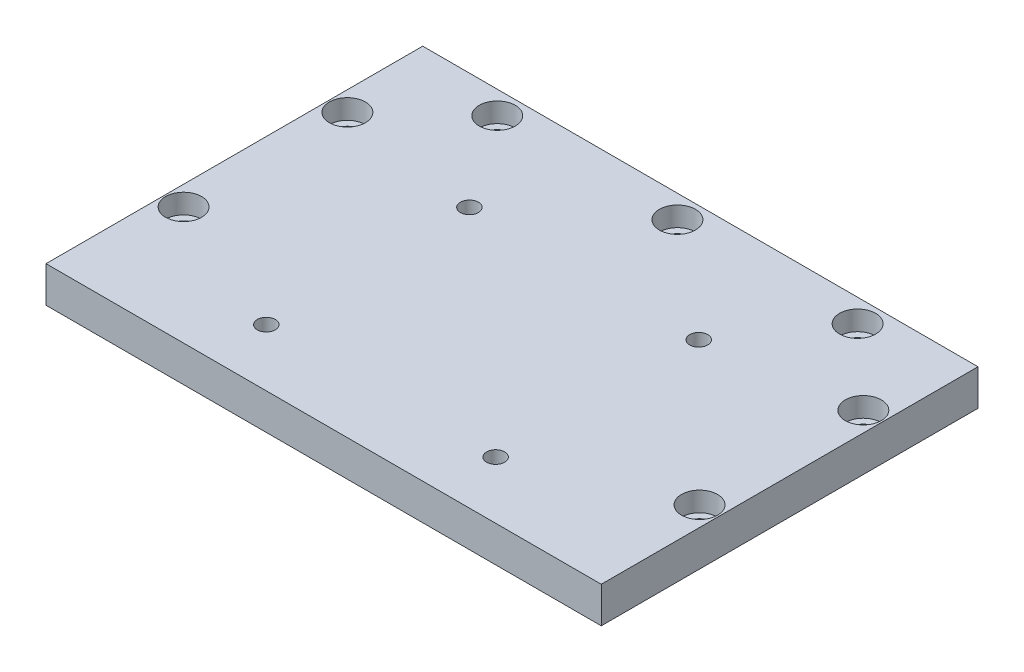
ISO-10303-21;
HEADER;
FILE_DESCRIPTION(('STEP AP214'),'2;1');
FILE_NAME('part.step','',(''),(''),'','','');
FILE_SCHEMA(('AUTOMOTIVE_DESIGN { 1 0 10303 214 1 1 1 1 }'));
ENDSEC;
DATA;
#1=APPLICATION_CONTEXT('core data for automotive mechanical design processes');
#2=APPLICATION_PROTOCOL_DEFINITION('international standard','automotive_design',2000,#1);
#3=PRODUCT_CONTEXT('',#1,'mechanical');
#4=PRODUCT('Part','Part','',(#3));
#5=PRODUCT_RELATED_PRODUCT_CATEGORY('part','',(#4));
#6=PRODUCT_DEFINITION_FORMATION('','',#4);
#7=PRODUCT_DEFINITION_CONTEXT('part definition',#1,'design');
#8=PRODUCT_DEFINITION('design','',#6,#7);
#9=PRODUCT_DEFINITION_SHAPE('','',#8);
#10=(LENGTH_UNIT() NAMED_UNIT(*) SI_UNIT(.MILLI.,.METRE.));
#11=(NAMED_UNIT(*) PLANE_ANGLE_UNIT() SI_UNIT($,.RADIAN.));
#12=(NAMED_UNIT(*) SI_UNIT($,.STERADIAN.) SOLID_ANGLE_UNIT());
#13=UNCERTAINTY_MEASURE_WITH_UNIT(LENGTH_MEASURE(1.E-05),#10,'distance_accuracy_value','');
#14=(GEOMETRIC_REPRESENTATION_CONTEXT(3) GLOBAL_UNCERTAINTY_ASSIGNED_CONTEXT((#13)) GLOBAL_UNIT_ASSIGNED_CONTEXT((#10,
#11,#12)) REPRESENTATION_CONTEXT('',''));
#15=CARTESIAN_POINT('',(0.,0.,0.));
#16=DIRECTION('',(0.,0.,1.));
#17=DIRECTION('',(1.,0.,0.));
#18=AXIS2_PLACEMENT_3D('',#15,#16,#17);
#19=CARTESIAN_POINT('',(78.75,0.,-36.));
#20=DIRECTION('',(0.,1.,0.));
#21=DIRECTION('',(0.,0.,1.));
#22=AXIS2_PLACEMENT_3D('',#19,#20,#21);
#23=CYLINDRICAL_SURFACE('',#22,5.5);
#24=CARTESIAN_POINT('',(78.75,-6.,-36.));
#25=DIRECTION('',(0.,1.,0.));
#26=DIRECTION('',(0.,0.,1.));
#27=AXIS2_PLACEMENT_3D('',#24,#25,#26);
#28=CIRCLE('',#27,5.5);
#29=CARTESIAN_POINT('',(78.75,-6.,-30.5));
#30=VERTEX_POINT('',#29);
#31=EDGE_CURVE('E20',#30,#30,#28,.F.);
#32=ORIENTED_EDGE('',*,*,#31,.T.);
#33=EDGE_LOOP('',(#32));
#34=FACE_BOUND('',#33,.T.);
#35=CARTESIAN_POINT('',(78.75,0.,-36.));
#36=DIRECTION('',(0.,1.,0.));
#37=DIRECTION('',(0.,0.,1.));
#38=AXIS2_PLACEMENT_3D('',#35,#36,#37);
#39=CIRCLE('',#38,5.5);
#40=CARTESIAN_POINT('',(78.75,0.,-30.5));
#41=VERTEX_POINT('',#40);
#42=EDGE_CURVE('E180',#41,#41,#39,.T.);
#43=ORIENTED_EDGE('',*,*,#42,.T.);
#44=EDGE_LOOP('',(#43));
#45=FACE_BOUND('',#44,.T.);
#46=ADVANCED_FACE('F17',(#34,#45),#23,.F.);
#47=CARTESIAN_POINT('',(78.75,0.,-86.));
#48=DIRECTION('',(0.,1.,0.));
#49=DIRECTION('',(0.,0.,1.));
#50=AXIS2_PLACEMENT_3D('',#47,#48,#49);
#51=CYLINDRICAL_SURFACE('',#50,5.50000000000001);
#52=CARTESIAN_POINT('',(78.75,-6.,-86.));
#53=DIRECTION('',(0.,1.,0.));
#54=DIRECTION('',(0.,0.,1.));
#55=AXIS2_PLACEMENT_3D('',#52,#53,#54);
#56=CIRCLE('',#55,5.50000000000001);
#57=CARTESIAN_POINT('',(78.75,-6.,-80.5));
#58=VERTEX_POINT('',#57);
#59=EDGE_CURVE('E209',#58,#58,#56,.F.);
#60=ORIENTED_EDGE('',*,*,#59,.T.);
#61=EDGE_LOOP('',(#60));
#62=FACE_BOUND('',#61,.T.);
#63=CARTESIAN_POINT('',(78.75,0.,-86.));
#64=DIRECTION('',(0.,1.,0.));
#65=DIRECTION('',(0.,0.,1.));
#66=AXIS2_PLACEMENT_3D('',#63,#64,#65);
#67=CIRCLE('',#66,5.50000000000001);
#68=CARTESIAN_POINT('',(78.75,0.,-80.5));
#69=VERTEX_POINT('',#68);
#70=EDGE_CURVE('E177',#69,#69,#67,.T.);
#71=ORIENTED_EDGE('',*,*,#70,.T.);
#72=EDGE_LOOP('',(#71));
#73=FACE_BOUND('',#72,.T.);
#74=ADVANCED_FACE('F367',(#62,#73),#51,.F.);
#75=CARTESIAN_POINT('',(55.,0.,-108.));
#76=DIRECTION('',(0.,1.,0.));
#77=DIRECTION('',(0.,0.,1.));
#78=AXIS2_PLACEMENT_3D('',#75,#76,#77);
#79=CYLINDRICAL_SURFACE('',#78,5.50000000000001);
#80=CARTESIAN_POINT('',(55.,-6.,-108.));
#81=DIRECTION('',(0.,1.,0.));
#82=DIRECTION('',(0.,0.,1.));
#83=AXIS2_PLACEMENT_3D('',#80,#81,#82);
#84=CIRCLE('',#83,5.50000000000001);
#85=CARTESIAN_POINT('',(55.,-6.,-102.5));
#86=VERTEX_POINT('',#85);
#87=EDGE_CURVE('E207',#86,#86,#84,.F.);
#88=ORIENTED_EDGE('',*,*,#87,.T.);
#89=EDGE_LOOP('',(#88));
#90=FACE_BOUND('',#89,.T.);
#91=CARTESIAN_POINT('',(55.,0.,-108.));
#92=DIRECTION('',(0.,1.,0.));
#93=DIRECTION('',(0.,0.,1.));
#94=AXIS2_PLACEMENT_3D('',#91,#92,#93);
#95=CIRCLE('',#94,5.50000000000001);
#96=CARTESIAN_POINT('',(55.,0.,-102.5));
#97=VERTEX_POINT('',#96);
#98=EDGE_CURVE('E174',#97,#97,#95,.T.);
#99=ORIENTED_EDGE('',*,*,#98,.T.);
#100=EDGE_LOOP('',(#99));
#101=FACE_BOUND('',#100,.T.);
#102=ADVANCED_FACE('F364',(#90,#101),#79,.F.);
#103=CARTESIAN_POINT('',(0.,0.,-108.));
#104=DIRECTION('',(0.,1.,0.));
#105=DIRECTION('',(0.,0.,1.));
#106=AXIS2_PLACEMENT_3D('',#103,#104,#105);
#107=CYLINDRICAL_SURFACE('',#106,5.50000000000001);
#108=CARTESIAN_POINT('',(0.,-6.,-108.));
#109=DIRECTION('',(0.,1.,0.));
#110=DIRECTION('',(0.,0.,1.));
#111=AXIS2_PLACEMENT_3D('',#108,#109,#110);
#112=CIRCLE('',#111,5.50000000000001);
#113=CARTESIAN_POINT('',(0.,-6.,-102.5));
#114=VERTEX_POINT('',#113);
#115=EDGE_CURVE('E204',#114,#114,#112,.F.);
#116=ORIENTED_EDGE('',*,*,#115,.T.);
#117=EDGE_LOOP('',(#116));
#118=FACE_BOUND('',#117,.T.);
#119=CARTESIAN_POINT('',(0.,0.,-108.));
#120=DIRECTION('',(0.,1.,0.));
#121=DIRECTION('',(0.,0.,1.));
#122=AXIS2_PLACEMENT_3D('',#119,#120,#121);
#123=CIRCLE('',#122,5.50000000000001);
#124=CARTESIAN_POINT('',(0.,0.,-102.5));
#125=VERTEX_POINT('',#124);
#126=EDGE_CURVE('E171',#125,#125,#123,.T.);
#127=ORIENTED_EDGE('',*,*,#126,.T.);
#128=EDGE_LOOP('',(#127));
#129=FACE_BOUND('',#128,.T.);
#130=ADVANCED_FACE('F360',(#118,#129),#107,.F.);
#131=CARTESIAN_POINT('',(-55.,0.,-108.));
#132=DIRECTION('',(0.,1.,0.));
#133=DIRECTION('',(0.,0.,1.));
#134=AXIS2_PLACEMENT_3D('',#131,#132,#133);
#135=CYLINDRICAL_SURFACE('',#134,5.50000000000001);
#136=CARTESIAN_POINT('',(-55.,-6.,-108.));
#137=DIRECTION('',(0.,1.,0.));
#138=DIRECTION('',(0.,0.,1.));
#139=AXIS2_PLACEMENT_3D('',#136,#137,#138);
#140=CIRCLE('',#139,5.50000000000001);
#141=CARTESIAN_POINT('',(-55.,-6.,-102.5));
#142=VERTEX_POINT('',#141);
#143=EDGE_CURVE('E201',#142,#142,#140,.F.);
#144=ORIENTED_EDGE('',*,*,#143,.T.);
#145=EDGE_LOOP('',(#144));
#146=FACE_BOUND('',#145,.T.);
#147=CARTESIAN_POINT('',(-55.,0.,-108.));
#148=DIRECTION('',(0.,1.,0.));
#149=DIRECTION('',(0.,0.,1.));
#150=AXIS2_PLACEMENT_3D('',#147,#148,#149);
#151=CIRCLE('',#150,5.50000000000001);
#152=CARTESIAN_POINT('',(-55.,0.,-102.5));
#153=VERTEX_POINT('',#152);
#154=EDGE_CURVE('E168',#153,#153,#151,.T.);
#155=ORIENTED_EDGE('',*,*,#154,.T.);
#156=EDGE_LOOP('',(#155));
#157=FACE_BOUND('',#156,.T.);
#158=ADVANCED_FACE('F356',(#146,#157),#135,.F.);
#159=CARTESIAN_POINT('',(-78.75,0.,-36.));
#160=DIRECTION('',(0.,1.,0.));
#161=DIRECTION('',(0.,0.,1.));
#162=AXIS2_PLACEMENT_3D('',#159,#160,#161);
#163=CYLINDRICAL_SURFACE('',#162,5.5);
#164=CARTESIAN_POINT('',(-78.75,-6.,-36.));
#165=DIRECTION('',(0.,1.,0.));
#166=DIRECTION('',(0.,0.,1.));
#167=AXIS2_PLACEMENT_3D('',#164,#165,#166);
#168=CIRCLE('',#167,5.5);
#169=CARTESIAN_POINT('',(-78.75,-6.,-30.5));
#170=VERTEX_POINT('',#169);
#171=EDGE_CURVE('E198',#170,#170,#168,.F.);
#172=ORIENTED_EDGE('',*,*,#171,.T.);
#173=EDGE_LOOP('',(#172));
#174=FACE_BOUND('',#173,.T.);
#175=CARTESIAN_POINT('',(-78.75,0.,-36.));
#176=DIRECTION('',(0.,1.,0.));
#177=DIRECTION('',(0.,0.,1.));
#178=AXIS2_PLACEMENT_3D('',#175,#176,#177);
#179=CIRCLE('',#178,5.5);
#180=CARTESIAN_POINT('',(-78.75,0.,-30.5));
#181=VERTEX_POINT('',#180);
#182=EDGE_CURVE('E165',#181,#181,#179,.T.);
#183=ORIENTED_EDGE('',*,*,#182,.T.);
#184=EDGE_LOOP('',(#183));
#185=FACE_BOUND('',#184,.T.);
#186=ADVANCED_FACE('F352',(#174,#185),#163,.F.);
#187=CARTESIAN_POINT('',(-78.75,0.,-86.));
#188=DIRECTION('',(0.,1.,0.));
#189=DIRECTION('',(0.,0.,1.));
#190=AXIS2_PLACEMENT_3D('',#187,#188,#189);
#191=CYLINDRICAL_SURFACE('',#190,5.50000000000001);
#192=CARTESIAN_POINT('',(-78.75,-6.,-86.));
#193=DIRECTION('',(0.,1.,0.));
#194=DIRECTION('',(0.,0.,1.));
#195=AXIS2_PLACEMENT_3D('',#192,#193,#194);
#196=CIRCLE('',#195,5.50000000000001);
#197=CARTESIAN_POINT('',(-78.75,-6.,-80.5));
#198=VERTEX_POINT('',#197);
#199=EDGE_CURVE('E195',#198,#198,#196,.F.);
#200=ORIENTED_EDGE('',*,*,#199,.T.);
#201=EDGE_LOOP('',(#200));
#202=FACE_BOUND('',#201,.T.);
#203=CARTESIAN_POINT('',(-78.75,0.,-86.));
#204=DIRECTION('',(0.,1.,0.));
#205=DIRECTION('',(0.,0.,1.));
#206=AXIS2_PLACEMENT_3D('',#203,#204,#205);
#207=CIRCLE('',#206,5.50000000000001);
#208=CARTESIAN_POINT('',(-78.75,0.,-80.5));
#209=VERTEX_POINT('',#208);
#210=EDGE_CURVE('E162',#209,#209,#207,.T.);
#211=ORIENTED_EDGE('',*,*,#210,.T.);
#212=EDGE_LOOP('',(#211));
#213=FACE_BOUND('',#212,.T.);
#214=ADVANCED_FACE('F348',(#202,#213),#191,.F.);
#215=CARTESIAN_POINT('',(35.,-11.,-17.5));
#216=DIRECTION('',(0.,-1.,0.));
#217=DIRECTION('',(0.,0.,-1.));
#218=AXIS2_PLACEMENT_3D('',#215,#216,#217);
#219=CYLINDRICAL_SURFACE('',#218,2.75);
#220=CARTESIAN_POINT('',(35.,-6.,-17.5));
#221=DIRECTION('',(0.,-1.,0.));
#222=DIRECTION('',(0.,0.,-1.));
#223=AXIS2_PLACEMENT_3D('',#220,#221,#222);
#224=CIRCLE('',#223,2.75);
#225=CARTESIAN_POINT('',(35.,-6.,-20.25));
#226=VERTEX_POINT('',#225);
#227=EDGE_CURVE('E192',#226,#226,#224,.T.);
#228=ORIENTED_EDGE('',*,*,#227,.T.);
#229=EDGE_LOOP('',(#228));
#230=FACE_BOUND('',#229,.T.);
#231=CARTESIAN_POINT('',(35.,0.,-17.5));
#232=DIRECTION('',(0.,-1.,0.));
#233=DIRECTION('',(0.,0.,-1.));
#234=AXIS2_PLACEMENT_3D('',#231,#232,#233);
#235=CIRCLE('',#234,2.75);
#236=CARTESIAN_POINT('',(35.,0.,-20.25));
#237=VERTEX_POINT('',#236);
#238=EDGE_CURVE('E159',#237,#237,#235,.F.);
#239=ORIENTED_EDGE('',*,*,#238,.T.);
#240=EDGE_LOOP('',(#239));
#241=FACE_BOUND('',#240,.T.);
#242=ADVANCED_FACE('F344',(#230,#241),#219,.F.);
#243=CARTESIAN_POINT('',(35.,-11.,-79.5));
#244=DIRECTION('',(0.,-1.,0.));
#245=DIRECTION('',(0.,0.,-1.));
#246=AXIS2_PLACEMENT_3D('',#243,#244,#245);
#247=CYLINDRICAL_SURFACE('',#246,2.75);
#248=CARTESIAN_POINT('',(35.,-6.,-79.5));
#249=DIRECTION('',(0.,-1.,0.));
#250=DIRECTION('',(0.,0.,-1.));
#251=AXIS2_PLACEMENT_3D('',#248,#249,#250);
#252=CIRCLE('',#251,2.75);
#253=CARTESIAN_POINT('',(35.,-6.,-82.25));
#254=VERTEX_POINT('',#253);
#255=EDGE_CURVE('E189',#254,#254,#252,.T.);
#256=ORIENTED_EDGE('',*,*,#255,.T.);
#257=EDGE_LOOP('',(#256));
#258=FACE_BOUND('',#257,.T.);
#259=CARTESIAN_POINT('',(35.,0.,-79.5));
#260=DIRECTION('',(0.,-1.,0.));
#261=DIRECTION('',(0.,0.,-1.));
#262=AXIS2_PLACEMENT_3D('',#259,#260,#261);
#263=CIRCLE('',#262,2.75);
#264=CARTESIAN_POINT('',(35.,0.,-82.25));
#265=VERTEX_POINT('',#264);
#266=EDGE_CURVE('E156',#265,#265,#263,.F.);
#267=ORIENTED_EDGE('',*,*,#266,.T.);
#268=EDGE_LOOP('',(#267));
#269=FACE_BOUND('',#268,.T.);
#270=ADVANCED_FACE('F340',(#258,#269),#247,.F.);
#271=CARTESIAN_POINT('',(-35.,-11.,-79.5));
#272=DIRECTION('',(0.,-1.,0.));
#273=DIRECTION('',(0.,0.,-1.));
#274=AXIS2_PLACEMENT_3D('',#271,#272,#273);
#275=CYLINDRICAL_SURFACE('',#274,2.75);
#276=CARTESIAN_POINT('',(-35.,-6.,-79.5));
#277=DIRECTION('',(0.,-1.,0.));
#278=DIRECTION('',(0.,0.,-1.));
#279=AXIS2_PLACEMENT_3D('',#276,#277,#278);
#280=CIRCLE('',#279,2.75);
#281=CARTESIAN_POINT('',(-35.,-6.,-82.25));
#282=VERTEX_POINT('',#281);
#283=EDGE_CURVE('E186',#282,#282,#280,.T.);
#284=ORIENTED_EDGE('',*,*,#283,.T.);
#285=EDGE_LOOP('',(#284));
#286=FACE_BOUND('',#285,.T.);
#287=CARTESIAN_POINT('',(-35.,0.,-79.5));
#288=DIRECTION('',(0.,-1.,0.));
#289=DIRECTION('',(0.,0.,-1.));
#290=AXIS2_PLACEMENT_3D('',#287,#288,#289);
#291=CIRCLE('',#290,2.75);
#292=CARTESIAN_POINT('',(-35.,0.,-82.25));
#293=VERTEX_POINT('',#292);
#294=EDGE_CURVE('E153',#293,#293,#291,.F.);
#295=ORIENTED_EDGE('',*,*,#294,.T.);
#296=EDGE_LOOP('',(#295));
#297=FACE_BOUND('',#296,.T.);
#298=ADVANCED_FACE('F336',(#286,#297),#275,.F.);
#299=CARTESIAN_POINT('',(-35.,-11.,-17.5));
#300=DIRECTION('',(0.,-1.,0.));
#301=DIRECTION('',(0.,0.,-1.));
#302=AXIS2_PLACEMENT_3D('',#299,#300,#301);
#303=CYLINDRICAL_SURFACE('',#302,2.75);
#304=CARTESIAN_POINT('',(-35.,-6.,-17.5));
#305=DIRECTION('',(0.,-1.,0.));
#306=DIRECTION('',(0.,0.,-1.));
#307=AXIS2_PLACEMENT_3D('',#304,#305,#306);
#308=CIRCLE('',#307,2.75);
#309=CARTESIAN_POINT('',(-35.,-6.,-20.25));
#310=VERTEX_POINT('',#309);
#311=EDGE_CURVE('E183',#310,#310,#308,.T.);
#312=ORIENTED_EDGE('',*,*,#311,.T.);
#313=EDGE_LOOP('',(#312));
#314=FACE_BOUND('',#313,.T.);
#315=CARTESIAN_POINT('',(-35.,0.,-17.5));
#316=DIRECTION('',(0.,-1.,0.));
#317=DIRECTION('',(0.,0.,-1.));
#318=AXIS2_PLACEMENT_3D('',#315,#316,#317);
#319=CIRCLE('',#318,2.75);
#320=CARTESIAN_POINT('',(-35.,0.,-20.25));
#321=VERTEX_POINT('',#320);
#322=EDGE_CURVE('E150',#321,#321,#319,.F.);
#323=ORIENTED_EDGE('',*,*,#322,.T.);
#324=EDGE_LOOP('',(#323));
#325=FACE_BOUND('',#324,.T.);
#326=ADVANCED_FACE('F222',(#314,#325),#303,.F.);
#327=CARTESIAN_POINT('',(82.05,-6.,-36.));
#328=DIRECTION('',(0.,-1.,0.));
#329=DIRECTION('',(0.,0.,-1.));
#330=AXIS2_PLACEMENT_3D('',#327,#328,#329);
#331=PLANE('',#330);
#332=ORIENTED_EDGE('',*,*,#31,.F.);
#333=EDGE_LOOP('',(#332));
#334=FACE_BOUND('',#333,.T.);
#335=CARTESIAN_POINT('',(78.75,-6.,-36.));
#336=DIRECTION('',(0.,1.,0.));
#337=DIRECTION('',(0.,0.,1.));
#338=AXIS2_PLACEMENT_3D('',#335,#336,#337);
#339=CIRCLE('',#338,3.3);
#340=CARTESIAN_POINT('',(78.75,-6.,-32.7));
#341=VERTEX_POINT('',#340);
#342=EDGE_CURVE('E147',#341,#341,#339,.F.);
#343=ORIENTED_EDGE('',*,*,#342,.T.);
#344=EDGE_LOOP('',(#343));
#345=FACE_BOUND('',#344,.T.);
#346=ADVANCED_FACE('F218',(#334,#345),#331,.F.);
#347=CARTESIAN_POINT('',(82.05,-6.,-86.));
#348=DIRECTION('',(0.,-1.,0.));
#349=DIRECTION('',(0.,0.,-1.));
#350=AXIS2_PLACEMENT_3D('',#347,#348,#349);
#351=PLANE('',#350);
#352=ORIENTED_EDGE('',*,*,#59,.F.);
#353=EDGE_LOOP('',(#352));
#354=FACE_BOUND('',#353,.T.);
#355=CARTESIAN_POINT('',(78.75,-6.,-86.));
#356=DIRECTION('',(0.,1.,0.));
#357=DIRECTION('',(0.,0.,1.));
#358=AXIS2_PLACEMENT_3D('',#355,#356,#357);
#359=CIRCLE('',#358,3.3);
#360=CARTESIAN_POINT('',(78.75,-6.,-82.7));
#361=VERTEX_POINT('',#360);
#362=EDGE_CURVE('E144',#361,#361,#359,.F.);
#363=ORIENTED_EDGE('',*,*,#362,.T.);
#364=EDGE_LOOP('',(#363));
#365=FACE_BOUND('',#364,.T.);
#366=ADVANCED_FACE('F221',(#354,#365),#351,.F.);
#367=CARTESIAN_POINT('',(58.3,-6.,-108.));
#368=DIRECTION('',(0.,-1.,0.));
#369=DIRECTION('',(0.,0.,-1.));
#370=AXIS2_PLACEMENT_3D('',#367,#368,#369);
#371=PLANE('',#370);
#372=ORIENTED_EDGE('',*,*,#87,.F.);
#373=EDGE_LOOP('',(#372));
#374=FACE_BOUND('',#373,.T.);
#375=CARTESIAN_POINT('',(55.,-6.,-108.));
#376=DIRECTION('',(0.,1.,0.));
#377=DIRECTION('',(0.,0.,1.));
#378=AXIS2_PLACEMENT_3D('',#375,#376,#377);
#379=CIRCLE('',#378,3.3);
#380=CARTESIAN_POINT('',(55.,-6.,-104.7));
#381=VERTEX_POINT('',#380);
#382=EDGE_CURVE('E141',#381,#381,#379,.F.);
#383=ORIENTED_EDGE('',*,*,#382,.T.);
#384=EDGE_LOOP('',(#383));
#385=FACE_BOUND('',#384,.T.);
#386=ADVANCED_FACE('F326',(#374,#385),#371,.F.);
#387=CARTESIAN_POINT('',(3.3,-6.,-108.));
#388=DIRECTION('',(0.,-1.,0.));
#389=DIRECTION('',(0.,0.,-1.));
#390=AXIS2_PLACEMENT_3D('',#387,#388,#389);
#391=PLANE('',#390);
#392=ORIENTED_EDGE('',*,*,#115,.F.);
#393=EDGE_LOOP('',(#392));
#394=FACE_BOUND('',#393,.T.);
#395=CARTESIAN_POINT('',(0.,-6.,-108.));
#396=DIRECTION('',(0.,1.,0.));
#397=DIRECTION('',(0.,0.,1.));
#398=AXIS2_PLACEMENT_3D('',#395,#396,#397);
#399=CIRCLE('',#398,3.3);
#400=CARTESIAN_POINT('',(0.,-6.,-104.7));
#401=VERTEX_POINT('',#400);
#402=EDGE_CURVE('E138',#401,#401,#399,.F.);
#403=ORIENTED_EDGE('',*,*,#402,.T.);
#404=EDGE_LOOP('',(#403));
#405=FACE_BOUND('',#404,.T.);
#406=ADVANCED_FACE('F322',(#394,#405),#391,.F.);
#407=CARTESIAN_POINT('',(-51.7,-6.,-108.));
#408=DIRECTION('',(0.,-1.,0.));
#409=DIRECTION('',(0.,0.,-1.));
#410=AXIS2_PLACEMENT_3D('',#407,#408,#409);
#411=PLANE('',#410);
#412=ORIENTED_EDGE('',*,*,#143,.F.);
#413=EDGE_LOOP('',(#412));
#414=FACE_BOUND('',#413,.T.);
#415=CARTESIAN_POINT('',(-55.,-6.,-108.));
#416=DIRECTION('',(0.,1.,0.));
#417=DIRECTION('',(0.,0.,1.));
#418=AXIS2_PLACEMENT_3D('',#415,#416,#417);
#419=CIRCLE('',#418,3.3);
#420=CARTESIAN_POINT('',(-55.,-6.,-104.7));
#421=VERTEX_POINT('',#420);
#422=EDGE_CURVE('E135',#421,#421,#419,.F.);
#423=ORIENTED_EDGE('',*,*,#422,.T.);
#424=EDGE_LOOP('',(#423));
#425=FACE_BOUND('',#424,.T.);
#426=ADVANCED_FACE('F318',(#414,#425),#411,.F.);
#427=CARTESIAN_POINT('',(-75.45,-6.,-36.));
#428=DIRECTION('',(0.,-1.,0.));
#429=DIRECTION('',(0.,0.,-1.));
#430=AXIS2_PLACEMENT_3D('',#427,#428,#429);
#431=PLANE('',#430);
#432=ORIENTED_EDGE('',*,*,#171,.F.);
#433=EDGE_LOOP('',(#432));
#434=FACE_BOUND('',#433,.T.);
#435=CARTESIAN_POINT('',(-78.75,-6.,-36.));
#436=DIRECTION('',(0.,1.,0.));
#437=DIRECTION('',(0.,0.,1.));
#438=AXIS2_PLACEMENT_3D('',#435,#436,#437);
#439=CIRCLE('',#438,3.3);
#440=CARTESIAN_POINT('',(-78.75,-6.,-32.7));
#441=VERTEX_POINT('',#440);
#442=EDGE_CURVE('E132',#441,#441,#439,.F.);
#443=ORIENTED_EDGE('',*,*,#442,.T.);
#444=EDGE_LOOP('',(#443));
#445=FACE_BOUND('',#444,.T.);
#446=ADVANCED_FACE('F314',(#434,#445),#431,.F.);
#447=CARTESIAN_POINT('',(-75.45,-6.,-86.));
#448=DIRECTION('',(0.,-1.,0.));
#449=DIRECTION('',(0.,0.,-1.));
#450=AXIS2_PLACEMENT_3D('',#447,#448,#449);
#451=PLANE('',#450);
#452=ORIENTED_EDGE('',*,*,#199,.F.);
#453=EDGE_LOOP('',(#452));
#454=FACE_BOUND('',#453,.T.);
#455=CARTESIAN_POINT('',(-78.75,-6.,-86.));
#456=DIRECTION('',(0.,1.,0.));
#457=DIRECTION('',(0.,0.,1.));
#458=AXIS2_PLACEMENT_3D('',#455,#456,#457);
#459=CIRCLE('',#458,3.3);
#460=CARTESIAN_POINT('',(-78.75,-6.,-82.7));
#461=VERTEX_POINT('',#460);
#462=EDGE_CURVE('E129',#461,#461,#459,.F.);
#463=ORIENTED_EDGE('',*,*,#462,.T.);
#464=EDGE_LOOP('',(#463));
#465=FACE_BOUND('',#464,.T.);
#466=ADVANCED_FACE('F310',(#454,#465),#451,.F.);
#467=CARTESIAN_POINT('',(37.75,-6.,-17.5));
#468=DIRECTION('',(0.,1.,0.));
#469=DIRECTION('',(0.,0.,1.));
#470=AXIS2_PLACEMENT_3D('',#467,#468,#469);
#471=PLANE('',#470);
#472=CARTESIAN_POINT('',(35.,-6.,-17.5));
#473=DIRECTION('',(0.,-1.,0.));
#474=DIRECTION('',(0.,0.,-1.));
#475=AXIS2_PLACEMENT_3D('',#472,#473,#474);
#476=CIRCLE('',#475,5.);
#477=CARTESIAN_POINT('',(35.,-6.,-22.5));
#478=VERTEX_POINT('',#477);
#479=EDGE_CURVE('E126',#478,#478,#476,.T.);
#480=ORIENTED_EDGE('',*,*,#479,.T.);
#481=EDGE_LOOP('',(#480));
#482=FACE_BOUND('',#481,.T.);
#483=ORIENTED_EDGE('',*,*,#227,.F.);
#484=EDGE_LOOP('',(#483));
#485=FACE_BOUND('',#484,.T.);
#486=ADVANCED_FACE('F306',(#482,#485),#471,.F.);
#487=CARTESIAN_POINT('',(37.75,-6.,-79.5));
#488=DIRECTION('',(0.,1.,0.));
#489=DIRECTION('',(0.,0.,1.));
#490=AXIS2_PLACEMENT_3D('',#487,#488,#489);
#491=PLANE('',#490);
#492=CARTESIAN_POINT('',(35.,-6.,-79.5));
#493=DIRECTION('',(0.,-1.,0.));
#494=DIRECTION('',(0.,0.,-1.));
#495=AXIS2_PLACEMENT_3D('',#492,#493,#494);
#496=CIRCLE('',#495,5.);
#497=CARTESIAN_POINT('',(35.,-6.,-84.5));
#498=VERTEX_POINT('',#497);
#499=EDGE_CURVE('E123',#498,#498,#496,.T.);
#500=ORIENTED_EDGE('',*,*,#499,.T.);
#501=EDGE_LOOP('',(#500));
#502=FACE_BOUND('',#501,.T.);
#503=ORIENTED_EDGE('',*,*,#255,.F.);
#504=EDGE_LOOP('',(#503));
#505=FACE_BOUND('',#504,.T.);
#506=ADVANCED_FACE('F302',(#502,#505),#491,.F.);
#507=CARTESIAN_POINT('',(-32.25,-6.,-79.5));
#508=DIRECTION('',(0.,1.,0.));
#509=DIRECTION('',(0.,0.,1.));
#510=AXIS2_PLACEMENT_3D('',#507,#508,#509);
#511=PLANE('',#510);
#512=CARTESIAN_POINT('',(-35.,-6.,-79.5));
#513=DIRECTION('',(0.,-1.,0.));
#514=DIRECTION('',(0.,0.,-1.));
#515=AXIS2_PLACEMENT_3D('',#512,#513,#514);
#516=CIRCLE('',#515,5.);
#517=CARTESIAN_POINT('',(-35.,-6.,-84.5));
#518=VERTEX_POINT('',#517);
#519=EDGE_CURVE('E120',#518,#518,#516,.T.);
#520=ORIENTED_EDGE('',*,*,#519,.T.);
#521=EDGE_LOOP('',(#520));
#522=FACE_BOUND('',#521,.T.);
#523=ORIENTED_EDGE('',*,*,#283,.F.);
#524=EDGE_LOOP('',(#523));
#525=FACE_BOUND('',#524,.T.);
#526=ADVANCED_FACE('F298',(#522,#525),#511,.F.);
#527=CARTESIAN_POINT('',(-32.25,-6.,-17.5));
#528=DIRECTION('',(0.,1.,0.));
#529=DIRECTION('',(0.,0.,1.));
#530=AXIS2_PLACEMENT_3D('',#527,#528,#529);
#531=PLANE('',#530);
#532=CARTESIAN_POINT('',(-35.,-6.,-17.5));
#533=DIRECTION('',(0.,-1.,0.));
#534=DIRECTION('',(0.,0.,-1.));
#535=AXIS2_PLACEMENT_3D('',#532,#533,#534);
#536=CIRCLE('',#535,5.);
#537=CARTESIAN_POINT('',(-35.,-6.,-22.5));
#538=VERTEX_POINT('',#537);
#539=EDGE_CURVE('E69',#538,#538,#536,.T.);
#540=ORIENTED_EDGE('',*,*,#539,.T.);
#541=EDGE_LOOP('',(#540));
#542=FACE_BOUND('',#541,.T.);
#543=ORIENTED_EDGE('',*,*,#311,.F.);
#544=EDGE_LOOP('',(#543));
#545=FACE_BOUND('',#544,.T.);
#546=ADVANCED_FACE('F295',(#542,#545),#531,.F.);
#547=CARTESIAN_POINT('',(-84.75,0.,-115.));
#548=DIRECTION('',(0.,-1.,0.));
#549=DIRECTION('',(0.,0.,-1.));
#550=AXIS2_PLACEMENT_3D('',#547,#548,#549);
#551=PLANE('',#550);
#552=DIRECTION('',(-1.,0.,0.));
#553=VECTOR('',#552,1.);
#554=CARTESIAN_POINT('',(-84.75,0.,-115.));
#555=LINE('',#554,#553);
#556=CARTESIAN_POINT('',(-84.75,0.,-115.));
#557=VERTEX_POINT('',#556);
#558=CARTESIAN_POINT('',(84.75,0.,-115.));
#559=VERTEX_POINT('',#558);
#560=EDGE_CURVE('E73',#557,#559,#555,.F.);
#561=ORIENTED_EDGE('',*,*,#560,.F.);
#562=DIRECTION('',(0.,0.,1.));
#563=VECTOR('',#562,1.);
#564=CARTESIAN_POINT('',(-84.75,0.,1.110223024625E-13));
#565=LINE('',#564,#563);
#566=CARTESIAN_POINT('',(-84.75,0.,1.0547658425686E-13));
#567=VERTEX_POINT('',#566);
#568=EDGE_CURVE('E55',#567,#557,#565,.F.);
#569=ORIENTED_EDGE('',*,*,#568,.F.);
#570=DIRECTION('',(1.,0.,0.));
#571=VECTOR('',#570,1.);
#572=CARTESIAN_POINT('',(-84.75,0.,1.110223024625E-13));
#573=LINE('',#572,#571);
#574=CARTESIAN_POINT('',(84.75,0.,1.00798227789208E-13));
#575=VERTEX_POINT('',#574);
#576=EDGE_CURVE('E60',#575,#567,#573,.F.);
#577=ORIENTED_EDGE('',*,*,#576,.F.);
#578=DIRECTION('',(0.,0.,-1.));
#579=VECTOR('',#578,1.);
#580=CARTESIAN_POINT('',(84.75,0.,1.110223024625E-13));
#581=LINE('',#580,#579);
#582=EDGE_CURVE('E709',#559,#575,#581,.F.);
#583=ORIENTED_EDGE('',*,*,#582,.F.);
#584=EDGE_LOOP('',(#561,#569,#577,#583));
#585=FACE_BOUND('',#584,.T.);
#586=ORIENTED_EDGE('',*,*,#322,.F.);
#587=EDGE_LOOP('',(#586));
#588=FACE_BOUND('',#587,.T.);
#589=ORIENTED_EDGE('',*,*,#294,.F.);
#590=EDGE_LOOP('',(#589));
#591=FACE_BOUND('',#590,.T.);
#592=ORIENTED_EDGE('',*,*,#266,.F.);
#593=EDGE_LOOP('',(#592));
#594=FACE_BOUND('',#593,.T.);
#595=ORIENTED_EDGE('',*,*,#238,.F.);
#596=EDGE_LOOP('',(#595));
#597=FACE_BOUND('',#596,.T.);
#598=ORIENTED_EDGE('',*,*,#210,.F.);
#599=EDGE_LOOP('',(#598));
#600=FACE_BOUND('',#599,.T.);
#601=ORIENTED_EDGE('',*,*,#182,.F.);
#602=EDGE_LOOP('',(#601));
#603=FACE_BOUND('',#602,.T.);
#604=ORIENTED_EDGE('',*,*,#154,.F.);
#605=EDGE_LOOP('',(#604));
#606=FACE_BOUND('',#605,.T.);
#607=ORIENTED_EDGE('',*,*,#126,.F.);
#608=EDGE_LOOP('',(#607));
#609=FACE_BOUND('',#608,.T.);
#610=ORIENTED_EDGE('',*,*,#98,.F.);
#611=EDGE_LOOP('',(#610));
#612=FACE_BOUND('',#611,.T.);
#613=ORIENTED_EDGE('',*,*,#70,.F.);
#614=EDGE_LOOP('',(#613));
#615=FACE_BOUND('',#614,.T.);
#616=ORIENTED_EDGE('',*,*,#42,.F.);
#617=EDGE_LOOP('',(#616));
#618=FACE_BOUND('',#617,.T.);
#619=ADVANCED_FACE('F71',(#585,#588,#591,#594,#597,#600,#603,#606,#609,#612,#615,#618),#551,.F.);
#620=CARTESIAN_POINT('',(78.75,0.,-36.));
#621=DIRECTION('',(0.,1.,0.));
#622=DIRECTION('',(0.,0.,1.));
#623=AXIS2_PLACEMENT_3D('',#620,#621,#622);
#624=CYLINDRICAL_SURFACE('',#623,3.3);
#625=ORIENTED_EDGE('',*,*,#342,.F.);
#626=EDGE_LOOP('',(#625));
#627=FACE_BOUND('',#626,.T.);
#628=CARTESIAN_POINT('',(78.75,-11.,-36.));
#629=DIRECTION('',(0.,1.,0.));
#630=DIRECTION('',(0.,0.,1.));
#631=AXIS2_PLACEMENT_3D('',#628,#629,#630);
#632=CIRCLE('',#631,3.3);
#633=CARTESIAN_POINT('',(78.75,-11.,-32.7));
#634=VERTEX_POINT('',#633);
#635=EDGE_CURVE('E115',#634,#634,#632,.T.);
#636=ORIENTED_EDGE('',*,*,#635,.F.);
#637=EDGE_LOOP('',(#636));
#638=FACE_BOUND('',#637,.T.);
#639=ADVANCED_FACE('F226',(#627,#638),#624,.F.);
#640=CARTESIAN_POINT('',(78.75,0.,-86.));
#641=DIRECTION('',(0.,1.,0.));
#642=DIRECTION('',(0.,0.,1.));
#643=AXIS2_PLACEMENT_3D('',#640,#641,#642);
#644=CYLINDRICAL_SURFACE('',#643,3.3);
#645=ORIENTED_EDGE('',*,*,#362,.F.);
#646=EDGE_LOOP('',(#645));
#647=FACE_BOUND('',#646,.T.);
#648=CARTESIAN_POINT('',(78.75,-11.,-86.));
#649=DIRECTION('',(0.,1.,0.));
#650=DIRECTION('',(0.,0.,1.));
#651=AXIS2_PLACEMENT_3D('',#648,#649,#650);
#652=CIRCLE('',#651,3.3);
#653=CARTESIAN_POINT('',(78.75,-11.,-82.7));
#654=VERTEX_POINT('',#653);
#655=EDGE_CURVE('E112',#654,#654,#652,.T.);
#656=ORIENTED_EDGE('',*,*,#655,.F.);
#657=EDGE_LOOP('',(#656));
#658=FACE_BOUND('',#657,.T.);
#659=ADVANCED_FACE('F229',(#647,#658),#644,.F.);
#660=CARTESIAN_POINT('',(55.,0.,-108.));
#661=DIRECTION('',(0.,1.,0.));
#662=DIRECTION('',(0.,0.,1.));
#663=AXIS2_PLACEMENT_3D('',#660,#661,#662);
#664=CYLINDRICAL_SURFACE('',#663,3.3);
#665=ORIENTED_EDGE('',*,*,#382,.F.);
#666=EDGE_LOOP('',(#665));
#667=FACE_BOUND('',#666,.T.);
#668=CARTESIAN_POINT('',(55.,-11.,-108.));
#669=DIRECTION('',(0.,1.,0.));
#670=DIRECTION('',(0.,0.,1.));
#671=AXIS2_PLACEMENT_3D('',#668,#669,#670);
#672=CIRCLE('',#671,3.3);
#673=CARTESIAN_POINT('',(55.,-11.,-104.7));
#674=VERTEX_POINT('',#673);
#675=EDGE_CURVE('E109',#674,#674,#672,.T.);
#676=ORIENTED_EDGE('',*,*,#675,.F.);
#677=EDGE_LOOP('',(#676));
#678=FACE_BOUND('',#677,.T.);
#679=ADVANCED_FACE('F285',(#667,#678),#664,.F.);
#680=CARTESIAN_POINT('',(0.,0.,-108.));
#681=DIRECTION('',(0.,1.,0.));
#682=DIRECTION('',(0.,0.,1.));
#683=AXIS2_PLACEMENT_3D('',#680,#681,#682);
#684=CYLINDRICAL_SURFACE('',#683,3.3);
#685=ORIENTED_EDGE('',*,*,#402,.F.);
#686=EDGE_LOOP('',(#685));
#687=FACE_BOUND('',#686,.T.);
#688=CARTESIAN_POINT('',(0.,-11.,-108.));
#689=DIRECTION('',(0.,1.,0.));
#690=DIRECTION('',(0.,0.,1.));
#691=AXIS2_PLACEMENT_3D('',#688,#689,#690);
#692=CIRCLE('',#691,3.3);
#693=CARTESIAN_POINT('',(0.,-11.,-104.7));
#694=VERTEX_POINT('',#693);
#695=EDGE_CURVE('E106',#694,#694,#692,.T.);
#696=ORIENTED_EDGE('',*,*,#695,.F.);
#697=EDGE_LOOP('',(#696));
#698=FACE_BOUND('',#697,.T.);
#699=ADVANCED_FACE('F281',(#687,#698),#684,.F.);
#700=CARTESIAN_POINT('',(-55.,0.,-108.));
#701=DIRECTION('',(0.,1.,0.));
#702=DIRECTION('',(0.,0.,1.));
#703=AXIS2_PLACEMENT_3D('',#700,#701,#702);
#704=CYLINDRICAL_SURFACE('',#703,3.3);
#705=ORIENTED_EDGE('',*,*,#422,.F.);
#706=EDGE_LOOP('',(#705));
#707=FACE_BOUND('',#706,.T.);
#708=CARTESIAN_POINT('',(-55.,-11.,-108.));
#709=DIRECTION('',(0.,1.,0.));
#710=DIRECTION('',(0.,0.,1.));
#711=AXIS2_PLACEMENT_3D('',#708,#709,#710);
#712=CIRCLE('',#711,3.3);
#713=CARTESIAN_POINT('',(-55.,-11.,-104.7));
#714=VERTEX_POINT('',#713);
#715=EDGE_CURVE('E103',#714,#714,#712,.T.);
#716=ORIENTED_EDGE('',*,*,#715,.F.);
#717=EDGE_LOOP('',(#716));
#718=FACE_BOUND('',#717,.T.);
#719=ADVANCED_FACE('F277',(#707,#718),#704,.F.);
#720=CARTESIAN_POINT('',(-78.75,0.,-36.));
#721=DIRECTION('',(0.,1.,0.));
#722=DIRECTION('',(0.,0.,1.));
#723=AXIS2_PLACEMENT_3D('',#720,#721,#722);
#724=CYLINDRICAL_SURFACE('',#723,3.3);
#725=ORIENTED_EDGE('',*,*,#442,.F.);
#726=EDGE_LOOP('',(#725));
#727=FACE_BOUND('',#726,.T.);
#728=CARTESIAN_POINT('',(-78.75,-11.,-36.));
#729=DIRECTION('',(0.,1.,0.));
#730=DIRECTION('',(0.,0.,1.));
#731=AXIS2_PLACEMENT_3D('',#728,#729,#730);
#732=CIRCLE('',#731,3.3);
#733=CARTESIAN_POINT('',(-78.75,-11.,-32.7));
#734=VERTEX_POINT('',#733);
#735=EDGE_CURVE('E100',#734,#734,#732,.T.);
#736=ORIENTED_EDGE('',*,*,#735,.F.);
#737=EDGE_LOOP('',(#736));
#738=FACE_BOUND('',#737,.T.);
#739=ADVANCED_FACE('F273',(#727,#738),#724,.F.);
#740=CARTESIAN_POINT('',(-78.75,0.,-86.));
#741=DIRECTION('',(0.,1.,0.));
#742=DIRECTION('',(0.,0.,1.));
#743=AXIS2_PLACEMENT_3D('',#740,#741,#742);
#744=CYLINDRICAL_SURFACE('',#743,3.3);
#745=ORIENTED_EDGE('',*,*,#462,.F.);
#746=EDGE_LOOP('',(#745));
#747=FACE_BOUND('',#746,.T.);
#748=CARTESIAN_POINT('',(-78.75,-11.,-86.));
#749=DIRECTION('',(0.,1.,0.));
#750=DIRECTION('',(0.,0.,1.));
#751=AXIS2_PLACEMENT_3D('',#748,#749,#750);
#752=CIRCLE('',#751,3.3);
#753=CARTESIAN_POINT('',(-78.75,-11.,-82.7));
#754=VERTEX_POINT('',#753);
#755=EDGE_CURVE('E97',#754,#754,#752,.T.);
#756=ORIENTED_EDGE('',*,*,#755,.F.);
#757=EDGE_LOOP('',(#756));
#758=FACE_BOUND('',#757,.T.);
#759=ADVANCED_FACE('F269',(#747,#758),#744,.F.);
#760=CARTESIAN_POINT('',(35.,-11.,-17.5));
#761=DIRECTION('',(0.,-1.,0.));
#762=DIRECTION('',(0.,0.,-1.));
#763=AXIS2_PLACEMENT_3D('',#760,#761,#762);
#764=CYLINDRICAL_SURFACE('',#763,5.);
#765=ORIENTED_EDGE('',*,*,#479,.F.);
#766=EDGE_LOOP('',(#765));
#767=FACE_BOUND('',#766,.T.);
#768=CARTESIAN_POINT('',(35.,-11.,-17.5));
#769=DIRECTION('',(0.,-1.,0.));
#770=DIRECTION('',(0.,0.,-1.));
#771=AXIS2_PLACEMENT_3D('',#768,#769,#770);
#772=CIRCLE('',#771,5.);
#773=CARTESIAN_POINT('',(35.,-11.,-22.5));
#774=VERTEX_POINT('',#773);
#775=EDGE_CURVE('E94',#774,#774,#772,.F.);
#776=ORIENTED_EDGE('',*,*,#775,.F.);
#777=EDGE_LOOP('',(#776));
#778=FACE_BOUND('',#777,.T.);
#779=ADVANCED_FACE('F265',(#767,#778),#764,.F.);
#780=CARTESIAN_POINT('',(35.,-11.,-79.5));
#781=DIRECTION('',(0.,-1.,0.));
#782=DIRECTION('',(0.,0.,-1.));
#783=AXIS2_PLACEMENT_3D('',#780,#781,#782);
#784=CYLINDRICAL_SURFACE('',#783,5.);
#785=ORIENTED_EDGE('',*,*,#499,.F.);
#786=EDGE_LOOP('',(#785));
#787=FACE_BOUND('',#786,.T.);
#788=CARTESIAN_POINT('',(35.,-11.,-79.5));
#789=DIRECTION('',(0.,-1.,0.));
#790=DIRECTION('',(0.,0.,-1.));
#791=AXIS2_PLACEMENT_3D('',#788,#789,#790);
#792=CIRCLE('',#791,5.);
#793=CARTESIAN_POINT('',(35.,-11.,-84.5));
#794=VERTEX_POINT('',#793);
#795=EDGE_CURVE('E91',#794,#794,#792,.F.);
#796=ORIENTED_EDGE('',*,*,#795,.F.);
#797=EDGE_LOOP('',(#796));
#798=FACE_BOUND('',#797,.T.);
#799=ADVANCED_FACE('F261',(#787,#798),#784,.F.);
#800=CARTESIAN_POINT('',(-35.,-11.,-79.5));
#801=DIRECTION('',(0.,-1.,0.));
#802=DIRECTION('',(0.,0.,-1.));
#803=AXIS2_PLACEMENT_3D('',#800,#801,#802);
#804=CYLINDRICAL_SURFACE('',#803,5.);
#805=ORIENTED_EDGE('',*,*,#519,.F.);
#806=EDGE_LOOP('',(#805));
#807=FACE_BOUND('',#806,.T.);
#808=CARTESIAN_POINT('',(-35.,-11.,-79.5));
#809=DIRECTION('',(0.,-1.,0.));
#810=DIRECTION('',(0.,0.,-1.));
#811=AXIS2_PLACEMENT_3D('',#808,#809,#810);
#812=CIRCLE('',#811,5.);
#813=CARTESIAN_POINT('',(-35.,-11.,-84.5));
#814=VERTEX_POINT('',#813);
#815=EDGE_CURVE('E88',#814,#814,#812,.F.);
#816=ORIENTED_EDGE('',*,*,#815,.F.);
#817=EDGE_LOOP('',(#816));
#818=FACE_BOUND('',#817,.T.);
#819=ADVANCED_FACE('F257',(#807,#818),#804,.F.);
#820=CARTESIAN_POINT('',(-35.,-11.,-17.5));
#821=DIRECTION('',(0.,-1.,0.));
#822=DIRECTION('',(0.,0.,-1.));
#823=AXIS2_PLACEMENT_3D('',#820,#821,#822);
#824=CYLINDRICAL_SURFACE('',#823,5.);
#825=ORIENTED_EDGE('',*,*,#539,.F.);
#826=EDGE_LOOP('',(#825));
#827=FACE_BOUND('',#826,.T.);
#828=CARTESIAN_POINT('',(-35.,-11.,-17.5));
#829=DIRECTION('',(0.,-1.,0.));
#830=DIRECTION('',(0.,0.,-1.));
#831=AXIS2_PLACEMENT_3D('',#828,#829,#830);
#832=CIRCLE('',#831,5.);
#833=CARTESIAN_POINT('',(-35.,-11.,-22.5));
#834=VERTEX_POINT('',#833);
#835=EDGE_CURVE('E84',#834,#834,#832,.F.);
#836=ORIENTED_EDGE('',*,*,#835,.F.);
#837=EDGE_LOOP('',(#836));
#838=FACE_BOUND('',#837,.T.);
#839=ADVANCED_FACE('F254',(#827,#838),#824,.F.);
#840=CARTESIAN_POINT('',(-84.75,-11.,1.110223024625E-13));
#841=DIRECTION('',(0.,0.,1.));
#842=DIRECTION('',(1.,0.,0.));
#843=AXIS2_PLACEMENT_3D('',#840,#841,#842);
#844=PLANE('',#843);
#845=DIRECTION('',(0.,1.,0.));
#846=VECTOR('',#845,1.);
#847=CARTESIAN_POINT('',(-84.75,-11.,1.0271721744774E-13));
#848=LINE('',#847,#846);
#849=CARTESIAN_POINT('',(-84.75,-11.,1.0547658425686E-13));
#850=VERTEX_POINT('',#849);
#851=EDGE_CURVE('E62',#850,#567,#848,.T.);
#852=ORIENTED_EDGE('',*,*,#851,.F.);
#853=DIRECTION('',(1.,0.,0.));
#854=VECTOR('',#853,1.);
#855=CARTESIAN_POINT('',(-84.75,-11.,0.));
#856=LINE('',#855,#854);
#857=CARTESIAN_POINT('',(84.75,-11.,1.04267674741158E-13));
#858=VERTEX_POINT('',#857);
#859=EDGE_CURVE('E87',#858,#850,#856,.F.);
#860=ORIENTED_EDGE('',*,*,#859,.F.);
#861=DIRECTION('',(0.,1.,0.));
#862=VECTOR('',#861,1.);
#863=CARTESIAN_POINT('',(84.75,-11.,0.));
#864=LINE('',#863,#862);
#865=EDGE_CURVE('E65',#575,#858,#864,.F.);
#866=ORIENTED_EDGE('',*,*,#865,.F.);
#867=ORIENTED_EDGE('',*,*,#576,.T.);
#868=EDGE_LOOP('',(#852,#860,#866,#867));
#869=FACE_BOUND('',#868,.T.);
#870=ADVANCED_FACE('F61',(#869),#844,.T.);
#871=CARTESIAN_POINT('',(-84.75,-11.,1.110223024625E-13));
#872=DIRECTION('',(-1.,0.,0.));
#873=DIRECTION('',(0.,0.,1.));
#874=AXIS2_PLACEMENT_3D('',#871,#872,#873);
#875=PLANE('',#874);
#876=DIRECTION('',(0.,1.,0.));
#877=VECTOR('',#876,1.);
#878=CARTESIAN_POINT('',(-84.75,-11.,-115.));
#879=LINE('',#878,#877);
#880=CARTESIAN_POINT('',(-84.75,-11.,-115.));
#881=VERTEX_POINT('',#880);
#882=EDGE_CURVE('E75',#881,#557,#879,.T.);
#883=ORIENTED_EDGE('',*,*,#882,.F.);
#884=DIRECTION('',(0.,0.,-1.));
#885=VECTOR('',#884,1.);
#886=CARTESIAN_POINT('',(-84.75,-11.,-115.));
#887=LINE('',#886,#885);
#888=EDGE_CURVE('E79',#850,#881,#887,.T.);
#889=ORIENTED_EDGE('',*,*,#888,.F.);
#890=ORIENTED_EDGE('',*,*,#851,.T.);
#891=ORIENTED_EDGE('',*,*,#568,.T.);
#892=EDGE_LOOP('',(#883,#889,#890,#891));
#893=FACE_BOUND('',#892,.T.);
#894=ADVANCED_FACE('F77',(#893),#875,.T.);
#895=CARTESIAN_POINT('',(-84.75,-11.,-115.));
#896=DIRECTION('',(0.,0.,-1.));
#897=DIRECTION('',(-1.,0.,0.));
#898=AXIS2_PLACEMENT_3D('',#895,#896,#897);
#899=PLANE('',#898);
#900=DIRECTION('',(0.,1.,0.));
#901=VECTOR('',#900,1.);
#902=CARTESIAN_POINT('',(84.75,-11.,-115.));
#903=LINE('',#902,#901);
#904=CARTESIAN_POINT('',(84.75,-11.,-115.));
#905=VERTEX_POINT('',#904);
#906=EDGE_CURVE('E35',#905,#559,#903,.T.);
#907=ORIENTED_EDGE('',*,*,#906,.F.);
#908=DIRECTION('',(1.,0.,0.));
#909=VECTOR('',#908,1.);
#910=CARTESIAN_POINT('',(-84.75,-11.,-115.));
#911=LINE('',#910,#909);
#912=EDGE_CURVE('E26',#881,#905,#911,.T.);
#913=ORIENTED_EDGE('',*,*,#912,.F.);
#914=ORIENTED_EDGE('',*,*,#882,.T.);
#915=ORIENTED_EDGE('',*,*,#560,.T.);
#916=EDGE_LOOP('',(#907,#913,#914,#915));
#917=FACE_BOUND('',#916,.T.);
#918=ADVANCED_FACE('F242',(#917),#899,.T.);
#919=CARTESIAN_POINT('',(84.75,-11.,1.110223024625E-13));
#920=DIRECTION('',(1.,0.,0.));
#921=DIRECTION('',(0.,0.,-1.));
#922=AXIS2_PLACEMENT_3D('',#919,#920,#921);
#923=PLANE('',#922);
#924=ORIENTED_EDGE('',*,*,#865,.T.);
#925=DIRECTION('',(0.,0.,-1.));
#926=VECTOR('',#925,1.);
#927=CARTESIAN_POINT('',(84.75,-11.,-115.));
#928=LINE('',#927,#926);
#929=EDGE_CURVE('E11',#905,#858,#928,.F.);
#930=ORIENTED_EDGE('',*,*,#929,.F.);
#931=ORIENTED_EDGE('',*,*,#906,.T.);
#932=ORIENTED_EDGE('',*,*,#582,.T.);
#933=EDGE_LOOP('',(#924,#930,#931,#932));
#934=FACE_BOUND('',#933,.T.);
#935=ADVANCED_FACE('F235',(#934),#923,.T.);
#936=CARTESIAN_POINT('',(-84.75,-11.,-115.));
#937=DIRECTION('',(0.,-1.,0.));
#938=DIRECTION('',(0.,0.,-1.));
#939=AXIS2_PLACEMENT_3D('',#936,#937,#938);
#940=PLANE('',#939);
#941=ORIENTED_EDGE('',*,*,#912,.T.);
#942=ORIENTED_EDGE('',*,*,#929,.T.);
#943=ORIENTED_EDGE('',*,*,#859,.T.);
#944=ORIENTED_EDGE('',*,*,#888,.T.);
#945=EDGE_LOOP('',(#941,#942,#943,#944));
#946=FACE_BOUND('',#945,.T.);
#947=ORIENTED_EDGE('',*,*,#835,.T.);
#948=EDGE_LOOP('',(#947));
#949=FACE_BOUND('',#948,.T.);
#950=ORIENTED_EDGE('',*,*,#815,.T.);
#951=EDGE_LOOP('',(#950));
#952=FACE_BOUND('',#951,.T.);
#953=ORIENTED_EDGE('',*,*,#795,.T.);
#954=EDGE_LOOP('',(#953));
#955=FACE_BOUND('',#954,.T.);
#956=ORIENTED_EDGE('',*,*,#775,.T.);
#957=EDGE_LOOP('',(#956));
#958=FACE_BOUND('',#957,.T.);
#959=ORIENTED_EDGE('',*,*,#755,.T.);
#960=EDGE_LOOP('',(#959));
#961=FACE_BOUND('',#960,.T.);
#962=ORIENTED_EDGE('',*,*,#735,.T.);
#963=EDGE_LOOP('',(#962));
#964=FACE_BOUND('',#963,.T.);
#965=ORIENTED_EDGE('',*,*,#715,.T.);
#966=EDGE_LOOP('',(#965));
#967=FACE_BOUND('',#966,.T.);
#968=ORIENTED_EDGE('',*,*,#695,.T.);
#969=EDGE_LOOP('',(#968));
#970=FACE_BOUND('',#969,.T.);
#971=ORIENTED_EDGE('',*,*,#675,.T.);
#972=EDGE_LOOP('',(#971));
#973=FACE_BOUND('',#972,.T.);
#974=ORIENTED_EDGE('',*,*,#655,.T.);
#975=EDGE_LOOP('',(#974));
#976=FACE_BOUND('',#975,.T.);
#977=ORIENTED_EDGE('',*,*,#635,.T.);
#978=EDGE_LOOP('',(#977));
#979=FACE_BOUND('',#978,.T.);
#980=ADVANCED_FACE('F233',(#946,#949,#952,#955,#958,#961,#964,#967,#970,#973,#976,#979),#940,.T.);
#981=CLOSED_SHELL('',(#46,#74,#102,#130,#158,#186,#214,#242,#270,#298,#326,#346,#366,#386,#406,
#426,#446,#466,#486,#506,#526,#546,#619,#639,#659,#679,#699,#719,#739,#759,#779,#799,#819,#839,
#870,#894,#918,#935,#980));
#982=MANIFOLD_SOLID_BREP('B1',#981);
#983=ADVANCED_BREP_SHAPE_REPRESENTATION('',(#18,#982),#14);
#984=SHAPE_DEFINITION_REPRESENTATION(#9,#983);
ENDSEC;
END-ISO-10303-21;
